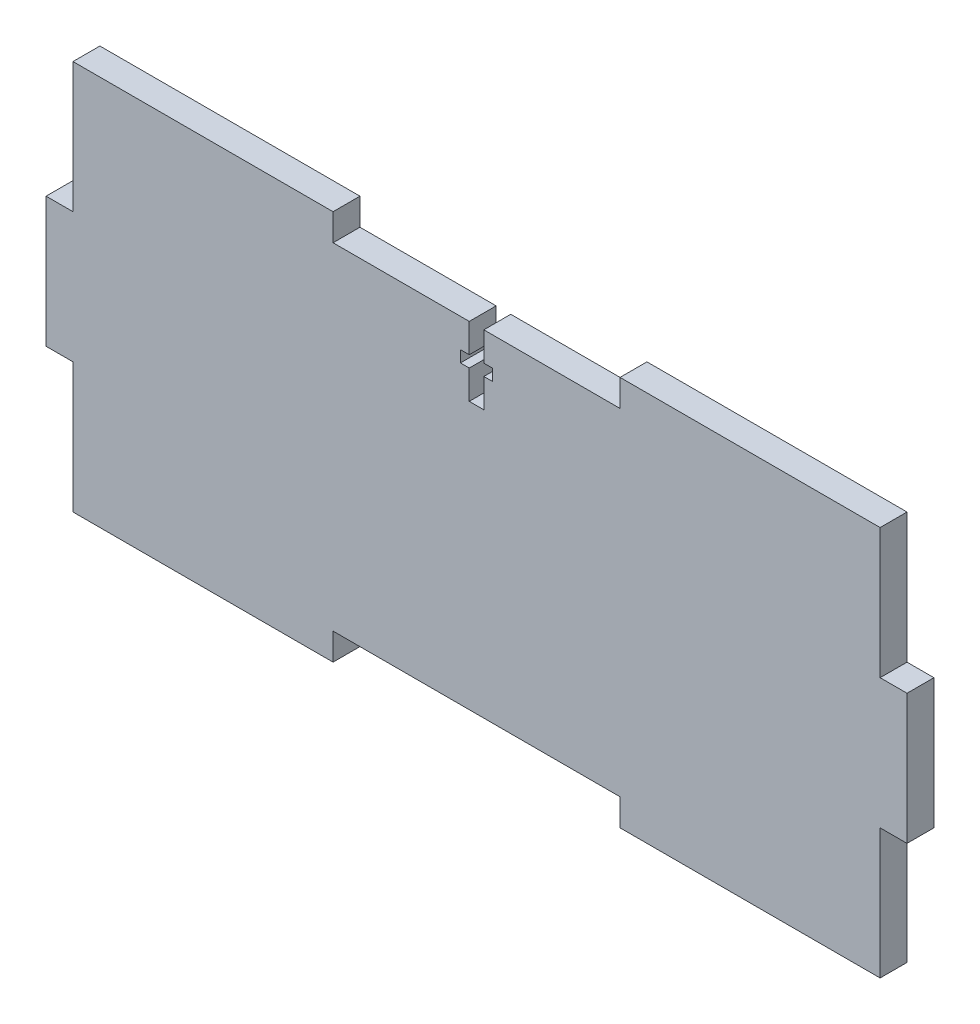
ISO-10303-21;
HEADER;
FILE_DESCRIPTION(('STEP AP214'),'2;1');
FILE_NAME('part.step','',(''),(''),'','','');
FILE_SCHEMA(('AUTOMOTIVE_DESIGN { 1 0 10303 214 1 1 1 1 }'));
ENDSEC;
DATA;
#1=APPLICATION_CONTEXT('core data for automotive mechanical design processes');
#2=APPLICATION_PROTOCOL_DEFINITION('international standard','automotive_design',2000,#1);
#3=PRODUCT_CONTEXT('',#1,'mechanical');
#4=PRODUCT('Part','Part','',(#3));
#5=PRODUCT_RELATED_PRODUCT_CATEGORY('part','',(#4));
#6=PRODUCT_DEFINITION_FORMATION('','',#4);
#7=PRODUCT_DEFINITION_CONTEXT('part definition',#1,'design');
#8=PRODUCT_DEFINITION('design','',#6,#7);
#9=PRODUCT_DEFINITION_SHAPE('','',#8);
#10=(LENGTH_UNIT() NAMED_UNIT(*) SI_UNIT(.MILLI.,.METRE.));
#11=(NAMED_UNIT(*) PLANE_ANGLE_UNIT() SI_UNIT($,.RADIAN.));
#12=(NAMED_UNIT(*) SI_UNIT($,.STERADIAN.) SOLID_ANGLE_UNIT());
#13=UNCERTAINTY_MEASURE_WITH_UNIT(LENGTH_MEASURE(1.E-05),#10,'distance_accuracy_value','');
#14=(GEOMETRIC_REPRESENTATION_CONTEXT(3) GLOBAL_UNCERTAINTY_ASSIGNED_CONTEXT((#13)) GLOBAL_UNIT_ASSIGNED_CONTEXT((#10,
#11,#12)) REPRESENTATION_CONTEXT('',''));
#15=CARTESIAN_POINT('',(0.,0.,0.));
#16=DIRECTION('',(0.,0.,1.));
#17=DIRECTION('',(1.,0.,0.));
#18=AXIS2_PLACEMENT_3D('',#15,#16,#17);
#19=CARTESIAN_POINT('',(-81.28,-36.83,5.08));
#20=DIRECTION('',(1.,0.,0.));
#21=DIRECTION('',(0.,0.,-1.));
#22=AXIS2_PLACEMENT_3D('',#19,#20,#21);
#23=PLANE('',#22);
#24=DIRECTION('',(0.,0.,1.));
#25=VECTOR('',#24,1.);
#26=CARTESIAN_POINT('',(-81.28,-12.2766666666667,5.08));
#27=LINE('',#26,#25);
#28=CARTESIAN_POINT('',(-81.28,-12.2766666666667,0.));
#29=VERTEX_POINT('',#28);
#30=CARTESIAN_POINT('',(-81.28,-12.2766666666667,5.08));
#31=VERTEX_POINT('',#30);
#32=EDGE_CURVE('E250',#29,#31,#27,.T.);
#33=ORIENTED_EDGE('',*,*,#32,.T.);
#34=DIRECTION('',(0.,-1.,0.));
#35=VECTOR('',#34,1.);
#36=CARTESIAN_POINT('',(-81.28,-36.83,5.08));
#37=LINE('',#36,#35);
#38=CARTESIAN_POINT('',(-81.28,12.2766666666667,5.08));
#39=VERTEX_POINT('',#38);
#40=EDGE_CURVE('E446',#39,#31,#37,.T.);
#41=ORIENTED_EDGE('',*,*,#40,.F.);
#42=DIRECTION('',(0.,0.,-1.));
#43=VECTOR('',#42,1.);
#44=CARTESIAN_POINT('',(-81.28,12.2766666666667,5.08));
#45=LINE('',#44,#43);
#46=CARTESIAN_POINT('',(-81.28,12.2766666666667,0.));
#47=VERTEX_POINT('',#46);
#48=EDGE_CURVE('E255',#39,#47,#45,.T.);
#49=ORIENTED_EDGE('',*,*,#48,.T.);
#50=DIRECTION('',(0.,-1.,0.));
#51=VECTOR('',#50,1.);
#52=CARTESIAN_POINT('',(-81.28,-36.83,0.));
#53=LINE('',#52,#51);
#54=EDGE_CURVE('E457',#47,#29,#53,.T.);
#55=ORIENTED_EDGE('',*,*,#54,.T.);
#56=EDGE_LOOP('',(#33,#41,#49,#55));
#57=FACE_BOUND('',#56,.T.);
#58=ADVANCED_FACE('F33',(#57),#23,.F.);
#59=CARTESIAN_POINT('',(81.28,-36.83,5.08));
#60=DIRECTION('',(-1.,0.,0.));
#61=DIRECTION('',(0.,0.,1.));
#62=AXIS2_PLACEMENT_3D('',#59,#60,#61);
#63=PLANE('',#62);
#64=DIRECTION('',(0.,0.,1.));
#65=VECTOR('',#64,1.);
#66=CARTESIAN_POINT('',(81.28,-12.2766666666667,5.08));
#67=LINE('',#66,#65);
#68=CARTESIAN_POINT('',(81.28,-12.2766666666667,0.));
#69=VERTEX_POINT('',#68);
#70=CARTESIAN_POINT('',(81.28,-12.2766666666667,5.08));
#71=VERTEX_POINT('',#70);
#72=EDGE_CURVE('E280',#69,#71,#67,.T.);
#73=ORIENTED_EDGE('',*,*,#72,.F.);
#74=DIRECTION('',(0.,1.,0.));
#75=VECTOR('',#74,1.);
#76=CARTESIAN_POINT('',(81.28,-36.83,0.));
#77=LINE('',#76,#75);
#78=CARTESIAN_POINT('',(81.28,12.2766666666667,0.));
#79=VERTEX_POINT('',#78);
#80=EDGE_CURVE('E432',#69,#79,#77,.T.);
#81=ORIENTED_EDGE('',*,*,#80,.T.);
#82=DIRECTION('',(0.,0.,-1.));
#83=VECTOR('',#82,1.);
#84=CARTESIAN_POINT('',(81.28,12.2766666666667,5.08));
#85=LINE('',#84,#83);
#86=CARTESIAN_POINT('',(81.28,12.2766666666667,5.08));
#87=VERTEX_POINT('',#86);
#88=EDGE_CURVE('E278',#87,#79,#85,.T.);
#89=ORIENTED_EDGE('',*,*,#88,.F.);
#90=DIRECTION('',(0.,1.,0.));
#91=VECTOR('',#90,1.);
#92=CARTESIAN_POINT('',(81.28,-36.83,5.08));
#93=LINE('',#92,#91);
#94=EDGE_CURVE('E440',#71,#87,#93,.T.);
#95=ORIENTED_EDGE('',*,*,#94,.F.);
#96=EDGE_LOOP('',(#73,#81,#89,#95));
#97=FACE_BOUND('',#96,.T.);
#98=ADVANCED_FACE('F35',(#97),#63,.F.);
#99=CARTESIAN_POINT('',(-81.28,36.83,5.08));
#100=DIRECTION('',(0.,-1.,0.));
#101=DIRECTION('',(0.,0.,-1.));
#102=AXIS2_PLACEMENT_3D('',#99,#100,#101);
#103=PLANE('',#102);
#104=DIRECTION('',(0.,0.,-1.));
#105=VECTOR('',#104,1.);
#106=CARTESIAN_POINT('',(76.2,36.83,-226.06));
#107=LINE('',#106,#105);
#108=CARTESIAN_POINT('',(76.2,36.83,5.08));
#109=VERTEX_POINT('',#108);
#110=CARTESIAN_POINT('',(76.2,36.83,0.));
#111=VERTEX_POINT('',#110);
#112=EDGE_CURVE('E302',#109,#111,#107,.T.);
#113=ORIENTED_EDGE('',*,*,#112,.T.);
#114=DIRECTION('',(-1.,0.,0.));
#115=VECTOR('',#114,1.);
#116=CARTESIAN_POINT('',(-81.28,36.83,0.));
#117=LINE('',#116,#115);
#118=CARTESIAN_POINT('',(27.0933333333333,36.83,0.));
#119=VERTEX_POINT('',#118);
#120=EDGE_CURVE('E455',#111,#119,#117,.T.);
#121=ORIENTED_EDGE('',*,*,#120,.T.);
#122=DIRECTION('',(0.,0.,1.));
#123=VECTOR('',#122,1.);
#124=CARTESIAN_POINT('',(27.0933333333333,36.83,0.));
#125=LINE('',#124,#123);
#126=CARTESIAN_POINT('',(27.0933333333333,36.83,5.08));
#127=VERTEX_POINT('',#126);
#128=EDGE_CURVE('E433',#119,#127,#125,.T.);
#129=ORIENTED_EDGE('',*,*,#128,.T.);
#130=DIRECTION('',(-1.,0.,0.));
#131=VECTOR('',#130,1.);
#132=CARTESIAN_POINT('',(-81.28,36.83,5.08));
#133=LINE('',#132,#131);
#134=EDGE_CURVE('E444',#109,#127,#133,.T.);
#135=ORIENTED_EDGE('',*,*,#134,.F.);
#136=EDGE_LOOP('',(#113,#121,#129,#135));
#137=FACE_BOUND('',#136,.T.);
#138=ADVANCED_FACE('F523',(#137),#103,.F.);
#139=CARTESIAN_POINT('',(-81.28,-36.83,5.08));
#140=DIRECTION('',(0.,1.,0.));
#141=DIRECTION('',(0.,0.,1.));
#142=AXIS2_PLACEMENT_3D('',#139,#140,#141);
#143=PLANE('',#142);
#144=DIRECTION('',(0.,0.,1.));
#145=VECTOR('',#144,1.);
#146=CARTESIAN_POINT('',(76.2,-36.83,-226.06));
#147=LINE('',#146,#145);
#148=CARTESIAN_POINT('',(76.2,-36.83,0.));
#149=VERTEX_POINT('',#148);
#150=CARTESIAN_POINT('',(76.2,-36.83,5.08));
#151=VERTEX_POINT('',#150);
#152=EDGE_CURVE('E305',#149,#151,#147,.T.);
#153=ORIENTED_EDGE('',*,*,#152,.T.);
#154=DIRECTION('',(1.,0.,0.));
#155=VECTOR('',#154,1.);
#156=CARTESIAN_POINT('',(-81.28,-36.83,5.08));
#157=LINE('',#156,#155);
#158=CARTESIAN_POINT('',(27.0933333333333,-36.83,5.08));
#159=VERTEX_POINT('',#158);
#160=EDGE_CURVE('E448',#159,#151,#157,.T.);
#161=ORIENTED_EDGE('',*,*,#160,.F.);
#162=DIRECTION('',(0.,0.,1.));
#163=VECTOR('',#162,1.);
#164=CARTESIAN_POINT('',(27.0933333333333,-36.83,0.));
#165=LINE('',#164,#163);
#166=CARTESIAN_POINT('',(27.0933333333333,-36.83,0.));
#167=VERTEX_POINT('',#166);
#168=EDGE_CURVE('E393',#167,#159,#165,.T.);
#169=ORIENTED_EDGE('',*,*,#168,.F.);
#170=DIRECTION('',(1.,0.,0.));
#171=VECTOR('',#170,1.);
#172=CARTESIAN_POINT('',(-81.28,-36.83,0.));
#173=LINE('',#172,#171);
#174=EDGE_CURVE('E460',#167,#149,#173,.T.);
#175=ORIENTED_EDGE('',*,*,#174,.T.);
#176=EDGE_LOOP('',(#153,#161,#169,#175));
#177=FACE_BOUND('',#176,.T.);
#178=ADVANCED_FACE('F478',(#177),#143,.F.);
#179=CARTESIAN_POINT('',(0.,0.,5.08));
#180=DIRECTION('',(0.,0.,-1.));
#181=DIRECTION('',(-1.,0.,0.));
#182=AXIS2_PLACEMENT_3D('',#179,#180,#181);
#183=PLANE('',#182);
#184=DIRECTION('',(-1.,0.,0.));
#185=VECTOR('',#184,1.);
#186=CARTESIAN_POINT('',(-76.2,-12.2766666666667,5.08));
#187=LINE('',#186,#185);
#188=CARTESIAN_POINT('',(-76.2,-12.2766666666667,5.08));
#189=VERTEX_POINT('',#188);
#190=EDGE_CURVE('E48',#189,#31,#187,.T.);
#191=ORIENTED_EDGE('',*,*,#190,.F.);
#192=DIRECTION('',(0.,1.,0.));
#193=VECTOR('',#192,1.);
#194=CARTESIAN_POINT('',(-76.2,-36.83,5.08));
#195=LINE('',#194,#193);
#196=CARTESIAN_POINT('',(-76.2,-36.83,5.08));
#197=VERTEX_POINT('',#196);
#198=EDGE_CURVE('E265',#197,#189,#195,.T.);
#199=ORIENTED_EDGE('',*,*,#198,.F.);
#200=CARTESIAN_POINT('',(-27.0933333333333,-36.83,5.08));
#201=VERTEX_POINT('',#200);
#202=EDGE_CURVE('E449',#197,#201,#157,.T.);
#203=ORIENTED_EDGE('',*,*,#202,.T.);
#204=DIRECTION('',(0.,-1.,0.));
#205=VECTOR('',#204,1.);
#206=CARTESIAN_POINT('',(-27.0933333333333,-36.83,5.08));
#207=LINE('',#206,#205);
#208=CARTESIAN_POINT('',(-27.0933333333333,-31.75,5.08));
#209=VERTEX_POINT('',#208);
#210=EDGE_CURVE('E387',#209,#201,#207,.T.);
#211=ORIENTED_EDGE('',*,*,#210,.F.);
#212=DIRECTION('',(-1.,0.,0.));
#213=VECTOR('',#212,1.);
#214=CARTESIAN_POINT('',(-27.0933333333333,-31.75,5.08));
#215=LINE('',#214,#213);
#216=CARTESIAN_POINT('',(27.0933333333333,-31.75,5.08));
#217=VERTEX_POINT('',#216);
#218=EDGE_CURVE('E396',#217,#209,#215,.T.);
#219=ORIENTED_EDGE('',*,*,#218,.F.);
#220=DIRECTION('',(0.,1.,0.));
#221=VECTOR('',#220,1.);
#222=CARTESIAN_POINT('',(27.0933333333333,-36.83,5.08));
#223=LINE('',#222,#221);
#224=EDGE_CURVE('E375',#159,#217,#223,.T.);
#225=ORIENTED_EDGE('',*,*,#224,.F.);
#226=ORIENTED_EDGE('',*,*,#160,.T.);
#227=DIRECTION('',(0.,1.,0.));
#228=VECTOR('',#227,1.);
#229=CARTESIAN_POINT('',(76.2,-36.83,5.08));
#230=LINE('',#229,#228);
#231=CARTESIAN_POINT('',(76.2,-12.2766666666667,5.08));
#232=VERTEX_POINT('',#231);
#233=EDGE_CURVE('E299',#151,#232,#230,.T.);
#234=ORIENTED_EDGE('',*,*,#233,.T.);
#235=DIRECTION('',(-1.,0.,0.));
#236=VECTOR('',#235,1.);
#237=CARTESIAN_POINT('',(81.28,-12.2766666666667,5.08));
#238=LINE('',#237,#236);
#239=EDGE_CURVE('E288',#71,#232,#238,.T.);
#240=ORIENTED_EDGE('',*,*,#239,.F.);
#241=ORIENTED_EDGE('',*,*,#94,.T.);
#242=DIRECTION('',(-1.,0.,0.));
#243=VECTOR('',#242,1.);
#244=CARTESIAN_POINT('',(81.28,12.2766666666667,5.08));
#245=LINE('',#244,#243);
#246=CARTESIAN_POINT('',(76.2,12.2766666666667,5.08));
#247=VERTEX_POINT('',#246);
#248=EDGE_CURVE('E283',#87,#247,#245,.T.);
#249=ORIENTED_EDGE('',*,*,#248,.T.);
#250=EDGE_CURVE('E291',#247,#109,#230,.T.);
#251=ORIENTED_EDGE('',*,*,#250,.T.);
#252=ORIENTED_EDGE('',*,*,#134,.T.);
#253=DIRECTION('',(0.,1.,0.));
#254=VECTOR('',#253,1.);
#255=CARTESIAN_POINT('',(27.0933333333333,36.83,5.08));
#256=LINE('',#255,#254);
#257=CARTESIAN_POINT('',(27.0933333333333,31.75,5.08));
#258=VERTEX_POINT('',#257);
#259=EDGE_CURVE('E414',#258,#127,#256,.T.);
#260=ORIENTED_EDGE('',*,*,#259,.F.);
#261=DIRECTION('',(1.,0.,0.));
#262=VECTOR('',#261,1.);
#263=CARTESIAN_POINT('',(-27.0933333333333,31.75,5.08));
#264=LINE('',#263,#262);
#265=CARTESIAN_POINT('',(1.37795,31.75,5.08));
#266=VERTEX_POINT('',#265);
#267=EDGE_CURVE('E424',#266,#258,#264,.T.);
#268=ORIENTED_EDGE('',*,*,#267,.F.);
#269=DIRECTION('',(0.,1.,0.));
#270=VECTOR('',#269,1.);
#271=CARTESIAN_POINT('',(1.37795,31.75,5.08));
#272=LINE('',#271,#270);
#273=CARTESIAN_POINT('',(1.37795,26.29535,5.08));
#274=VERTEX_POINT('',#273);
#275=EDGE_CURVE('E369',#274,#266,#272,.T.);
#276=ORIENTED_EDGE('',*,*,#275,.F.);
#277=DIRECTION('',(-1.,0.,0.));
#278=VECTOR('',#277,1.);
#279=CARTESIAN_POINT('',(-3.048,26.29535,5.08));
#280=LINE('',#279,#278);
#281=CARTESIAN_POINT('',(3.048,26.29535,5.08));
#282=VERTEX_POINT('',#281);
#283=EDGE_CURVE('E313',#282,#274,#280,.T.);
#284=ORIENTED_EDGE('',*,*,#283,.F.);
#285=DIRECTION('',(0.,1.,0.));
#286=VECTOR('',#285,1.);
#287=CARTESIAN_POINT('',(3.048,26.29535,5.08));
#288=LINE('',#287,#286);
#289=CARTESIAN_POINT('',(3.048,24.12365,5.08));
#290=VERTEX_POINT('',#289);
#291=EDGE_CURVE('E330',#290,#282,#288,.T.);
#292=ORIENTED_EDGE('',*,*,#291,.F.);
#293=DIRECTION('',(1.,0.,0.));
#294=VECTOR('',#293,1.);
#295=CARTESIAN_POINT('',(-3.048,24.12365,5.08));
#296=LINE('',#295,#294);
#297=CARTESIAN_POINT('',(1.37795,24.12365,5.08));
#298=VERTEX_POINT('',#297);
#299=EDGE_CURVE('E327',#298,#290,#296,.T.);
#300=ORIENTED_EDGE('',*,*,#299,.F.);
#301=CARTESIAN_POINT('',(1.37795,18.669,5.08));
#302=VERTEX_POINT('',#301);
#303=EDGE_CURVE('E370',#302,#298,#272,.T.);
#304=ORIENTED_EDGE('',*,*,#303,.F.);
#305=DIRECTION('',(1.,0.,0.));
#306=VECTOR('',#305,1.);
#307=CARTESIAN_POINT('',(-1.37795,18.669,5.08));
#308=LINE('',#307,#306);
#309=CARTESIAN_POINT('',(-1.37795,18.669,5.08));
#310=VERTEX_POINT('',#309);
#311=EDGE_CURVE('E366',#310,#302,#308,.T.);
#312=ORIENTED_EDGE('',*,*,#311,.F.);
#313=DIRECTION('',(0.,-1.,0.));
#314=VECTOR('',#313,1.);
#315=CARTESIAN_POINT('',(-1.37795,31.75,5.08));
#316=LINE('',#315,#314);
#317=CARTESIAN_POINT('',(-1.37795,24.12365,5.08));
#318=VERTEX_POINT('',#317);
#319=EDGE_CURVE('E350',#318,#310,#316,.T.);
#320=ORIENTED_EDGE('',*,*,#319,.F.);
#321=CARTESIAN_POINT('',(-3.048,24.12365,5.08));
#322=VERTEX_POINT('',#321);
#323=EDGE_CURVE('E328',#322,#318,#296,.T.);
#324=ORIENTED_EDGE('',*,*,#323,.F.);
#325=DIRECTION('',(0.,-1.,0.));
#326=VECTOR('',#325,1.);
#327=CARTESIAN_POINT('',(-3.048,26.29535,5.08));
#328=LINE('',#327,#326);
#329=CARTESIAN_POINT('',(-3.048,26.29535,5.08));
#330=VERTEX_POINT('',#329);
#331=EDGE_CURVE('E308',#330,#322,#328,.T.);
#332=ORIENTED_EDGE('',*,*,#331,.F.);
#333=CARTESIAN_POINT('',(-1.37795,26.29535,5.08));
#334=VERTEX_POINT('',#333);
#335=EDGE_CURVE('E333',#334,#330,#280,.T.);
#336=ORIENTED_EDGE('',*,*,#335,.F.);
#337=CARTESIAN_POINT('',(-1.37795,31.75,5.08));
#338=VERTEX_POINT('',#337);
#339=EDGE_CURVE('E363',#338,#334,#316,.T.);
#340=ORIENTED_EDGE('',*,*,#339,.F.);
#341=CARTESIAN_POINT('',(-27.0933333333333,31.75,5.08));
#342=VERTEX_POINT('',#341);
#343=EDGE_CURVE('E425',#342,#338,#264,.T.);
#344=ORIENTED_EDGE('',*,*,#343,.F.);
#345=DIRECTION('',(0.,-1.,0.));
#346=VECTOR('',#345,1.);
#347=CARTESIAN_POINT('',(-27.0933333333333,36.83,5.08));
#348=LINE('',#347,#346);
#349=CARTESIAN_POINT('',(-27.0933333333333,36.83,5.08));
#350=VERTEX_POINT('',#349);
#351=EDGE_CURVE('E404',#350,#342,#348,.T.);
#352=ORIENTED_EDGE('',*,*,#351,.F.);
#353=CARTESIAN_POINT('',(-76.2,36.83,5.08));
#354=VERTEX_POINT('',#353);
#355=EDGE_CURVE('E264',#350,#354,#133,.T.);
#356=ORIENTED_EDGE('',*,*,#355,.T.);
#357=CARTESIAN_POINT('',(-76.2,12.2766666666667,5.08));
#358=VERTEX_POINT('',#357);
#359=EDGE_CURVE('E245',#358,#354,#195,.T.);
#360=ORIENTED_EDGE('',*,*,#359,.F.);
#361=DIRECTION('',(-1.,0.,0.));
#362=VECTOR('',#361,1.);
#363=CARTESIAN_POINT('',(-76.2,12.2766666666667,5.08));
#364=LINE('',#363,#362);
#365=EDGE_CURVE('E253',#358,#39,#364,.T.);
#366=ORIENTED_EDGE('',*,*,#365,.T.);
#367=ORIENTED_EDGE('',*,*,#40,.T.);
#368=EDGE_LOOP('',(#191,#199,#203,#211,#219,#225,#226,#234,#240,#241,#249,#251,#252,#260,#268,
#276,#284,#292,#300,#304,#312,#320,#324,#332,#336,#340,#344,#352,#356,#360,#366,#367));
#369=FACE_BOUND('',#368,.T.);
#370=ADVANCED_FACE('F261',(#369),#183,.F.);
#371=CARTESIAN_POINT('',(0.,0.,0.));
#372=DIRECTION('',(0.,0.,-1.));
#373=DIRECTION('',(-1.,0.,0.));
#374=AXIS2_PLACEMENT_3D('',#371,#372,#373);
#375=PLANE('',#374);
#376=DIRECTION('',(0.,-1.,0.));
#377=VECTOR('',#376,1.);
#378=CARTESIAN_POINT('',(-76.2,0.,0.));
#379=LINE('',#378,#377);
#380=CARTESIAN_POINT('',(-76.2,36.83,0.));
#381=VERTEX_POINT('',#380);
#382=CARTESIAN_POINT('',(-76.2,12.2766666666667,0.));
#383=VERTEX_POINT('',#382);
#384=EDGE_CURVE('E248',#381,#383,#379,.T.);
#385=ORIENTED_EDGE('',*,*,#384,.F.);
#386=CARTESIAN_POINT('',(-27.0933333333333,36.83,0.));
#387=VERTEX_POINT('',#386);
#388=EDGE_CURVE('E454',#387,#381,#117,.T.);
#389=ORIENTED_EDGE('',*,*,#388,.F.);
#390=DIRECTION('',(0.,-1.,0.));
#391=VECTOR('',#390,1.);
#392=CARTESIAN_POINT('',(-27.0933333333333,36.83,0.));
#393=LINE('',#392,#391);
#394=CARTESIAN_POINT('',(-27.0933333333333,31.75,0.));
#395=VERTEX_POINT('',#394);
#396=EDGE_CURVE('E410',#387,#395,#393,.T.);
#397=ORIENTED_EDGE('',*,*,#396,.T.);
#398=DIRECTION('',(1.,0.,0.));
#399=VECTOR('',#398,1.);
#400=CARTESIAN_POINT('',(-27.0933333333333,31.75,0.));
#401=LINE('',#400,#399);
#402=CARTESIAN_POINT('',(-1.37795,31.75,0.));
#403=VERTEX_POINT('',#402);
#404=EDGE_CURVE('E415',#395,#403,#401,.T.);
#405=ORIENTED_EDGE('',*,*,#404,.T.);
#406=DIRECTION('',(0.,-1.,0.));
#407=VECTOR('',#406,1.);
#408=CARTESIAN_POINT('',(-1.37795,31.75,0.));
#409=LINE('',#408,#407);
#410=CARTESIAN_POINT('',(-1.37795,26.29535,0.));
#411=VERTEX_POINT('',#410);
#412=EDGE_CURVE('E351',#403,#411,#409,.T.);
#413=ORIENTED_EDGE('',*,*,#412,.T.);
#414=DIRECTION('',(-1.,0.,0.));
#415=VECTOR('',#414,1.);
#416=CARTESIAN_POINT('',(-3.048,26.29535,0.));
#417=LINE('',#416,#415);
#418=CARTESIAN_POINT('',(-3.048,26.29535,0.));
#419=VERTEX_POINT('',#418);
#420=EDGE_CURVE('E320',#411,#419,#417,.T.);
#421=ORIENTED_EDGE('',*,*,#420,.T.);
#422=DIRECTION('',(0.,-1.,0.));
#423=VECTOR('',#422,1.);
#424=CARTESIAN_POINT('',(-3.048,26.29535,0.));
#425=LINE('',#424,#423);
#426=CARTESIAN_POINT('',(-3.048,24.12365,0.));
#427=VERTEX_POINT('',#426);
#428=EDGE_CURVE('E309',#419,#427,#425,.T.);
#429=ORIENTED_EDGE('',*,*,#428,.T.);
#430=DIRECTION('',(1.,0.,0.));
#431=VECTOR('',#430,1.);
#432=CARTESIAN_POINT('',(-3.048,24.12365,0.));
#433=LINE('',#432,#431);
#434=CARTESIAN_POINT('',(-1.37795,24.12365,0.));
#435=VERTEX_POINT('',#434);
#436=EDGE_CURVE('E314',#427,#435,#433,.T.);
#437=ORIENTED_EDGE('',*,*,#436,.T.);
#438=CARTESIAN_POINT('',(-1.37795,18.669,0.));
#439=VERTEX_POINT('',#438);
#440=EDGE_CURVE('E355',#435,#439,#409,.T.);
#441=ORIENTED_EDGE('',*,*,#440,.T.);
#442=DIRECTION('',(1.,0.,0.));
#443=VECTOR('',#442,1.);
#444=CARTESIAN_POINT('',(-1.37795,18.669,0.));
#445=LINE('',#444,#443);
#446=CARTESIAN_POINT('',(1.37795,18.669,0.));
#447=VERTEX_POINT('',#446);
#448=EDGE_CURVE('E354',#439,#447,#445,.T.);
#449=ORIENTED_EDGE('',*,*,#448,.T.);
#450=DIRECTION('',(0.,1.,0.));
#451=VECTOR('',#450,1.);
#452=CARTESIAN_POINT('',(1.37795,31.75,0.));
#453=LINE('',#452,#451);
#454=CARTESIAN_POINT('',(1.37795,24.12365,0.));
#455=VERTEX_POINT('',#454);
#456=EDGE_CURVE('E359',#447,#455,#453,.T.);
#457=ORIENTED_EDGE('',*,*,#456,.T.);
#458=CARTESIAN_POINT('',(3.048,24.12365,0.));
#459=VERTEX_POINT('',#458);
#460=EDGE_CURVE('E312',#455,#459,#433,.T.);
#461=ORIENTED_EDGE('',*,*,#460,.T.);
#462=DIRECTION('',(0.,1.,0.));
#463=VECTOR('',#462,1.);
#464=CARTESIAN_POINT('',(3.048,26.29535,0.));
#465=LINE('',#464,#463);
#466=CARTESIAN_POINT('',(3.048,26.29535,0.));
#467=VERTEX_POINT('',#466);
#468=EDGE_CURVE('E317',#459,#467,#465,.T.);
#469=ORIENTED_EDGE('',*,*,#468,.T.);
#470=CARTESIAN_POINT('',(1.37795,26.29535,0.));
#471=VERTEX_POINT('',#470);
#472=EDGE_CURVE('E321',#467,#471,#417,.T.);
#473=ORIENTED_EDGE('',*,*,#472,.T.);
#474=CARTESIAN_POINT('',(1.37795,31.75,0.));
#475=VERTEX_POINT('',#474);
#476=EDGE_CURVE('E358',#471,#475,#453,.T.);
#477=ORIENTED_EDGE('',*,*,#476,.T.);
#478=CARTESIAN_POINT('',(27.0933333333333,31.75,0.));
#479=VERTEX_POINT('',#478);
#480=EDGE_CURVE('E413',#475,#479,#401,.T.);
#481=ORIENTED_EDGE('',*,*,#480,.T.);
#482=DIRECTION('',(0.,1.,0.));
#483=VECTOR('',#482,1.);
#484=CARTESIAN_POINT('',(27.0933333333333,36.83,0.));
#485=LINE('',#484,#483);
#486=EDGE_CURVE('E418',#479,#119,#485,.T.);
#487=ORIENTED_EDGE('',*,*,#486,.T.);
#488=ORIENTED_EDGE('',*,*,#120,.F.);
#489=DIRECTION('',(0.,-1.,0.));
#490=VECTOR('',#489,1.);
#491=CARTESIAN_POINT('',(76.2,0.,0.));
#492=LINE('',#491,#490);
#493=CARTESIAN_POINT('',(76.2,12.2766666666667,0.));
#494=VERTEX_POINT('',#493);
#495=EDGE_CURVE('E11',#111,#494,#492,.T.);
#496=ORIENTED_EDGE('',*,*,#495,.T.);
#497=DIRECTION('',(-1.,0.,0.));
#498=VECTOR('',#497,1.);
#499=CARTESIAN_POINT('',(81.28,12.2766666666667,0.));
#500=LINE('',#499,#498);
#501=EDGE_CURVE('E295',#79,#494,#500,.T.);
#502=ORIENTED_EDGE('',*,*,#501,.F.);
#503=ORIENTED_EDGE('',*,*,#80,.F.);
#504=DIRECTION('',(-1.,0.,0.));
#505=VECTOR('',#504,1.);
#506=CARTESIAN_POINT('',(81.28,-12.2766666666667,0.));
#507=LINE('',#506,#505);
#508=CARTESIAN_POINT('',(76.2,-12.2766666666667,0.));
#509=VERTEX_POINT('',#508);
#510=EDGE_CURVE('E292',#69,#509,#507,.T.);
#511=ORIENTED_EDGE('',*,*,#510,.T.);
#512=EDGE_CURVE('E41',#509,#149,#492,.T.);
#513=ORIENTED_EDGE('',*,*,#512,.T.);
#514=ORIENTED_EDGE('',*,*,#174,.F.);
#515=DIRECTION('',(0.,1.,0.));
#516=VECTOR('',#515,1.);
#517=CARTESIAN_POINT('',(27.0933333333333,-36.83,0.));
#518=LINE('',#517,#516);
#519=CARTESIAN_POINT('',(27.0933333333333,-31.75,0.));
#520=VERTEX_POINT('',#519);
#521=EDGE_CURVE('E383',#167,#520,#518,.T.);
#522=ORIENTED_EDGE('',*,*,#521,.T.);
#523=DIRECTION('',(-1.,0.,0.));
#524=VECTOR('',#523,1.);
#525=CARTESIAN_POINT('',(-27.0933333333333,-31.75,0.));
#526=LINE('',#525,#524);
#527=CARTESIAN_POINT('',(-27.0933333333333,-31.75,0.));
#528=VERTEX_POINT('',#527);
#529=EDGE_CURVE('E386',#520,#528,#526,.T.);
#530=ORIENTED_EDGE('',*,*,#529,.T.);
#531=DIRECTION('',(0.,-1.,0.));
#532=VECTOR('',#531,1.);
#533=CARTESIAN_POINT('',(-27.0933333333333,-36.83,0.));
#534=LINE('',#533,#532);
#535=CARTESIAN_POINT('',(-27.0933333333333,-36.83,0.));
#536=VERTEX_POINT('',#535);
#537=EDGE_CURVE('E390',#528,#536,#534,.T.);
#538=ORIENTED_EDGE('',*,*,#537,.T.);
#539=CARTESIAN_POINT('',(-76.2,-36.83,0.));
#540=VERTEX_POINT('',#539);
#541=EDGE_CURVE('E443',#540,#536,#173,.T.);
#542=ORIENTED_EDGE('',*,*,#541,.F.);
#543=CARTESIAN_POINT('',(-76.2,-12.2766666666667,0.));
#544=VERTEX_POINT('',#543);
#545=EDGE_CURVE('E276',#544,#540,#379,.T.);
#546=ORIENTED_EDGE('',*,*,#545,.F.);
#547=DIRECTION('',(-1.,0.,0.));
#548=VECTOR('',#547,1.);
#549=CARTESIAN_POINT('',(-76.2,-12.2766666666667,0.));
#550=LINE('',#549,#548);
#551=EDGE_CURVE('E269',#544,#29,#550,.T.);
#552=ORIENTED_EDGE('',*,*,#551,.T.);
#553=ORIENTED_EDGE('',*,*,#54,.F.);
#554=DIRECTION('',(-1.,0.,0.));
#555=VECTOR('',#554,1.);
#556=CARTESIAN_POINT('',(-76.2,12.2766666666667,0.));
#557=LINE('',#556,#555);
#558=EDGE_CURVE('E56',#383,#47,#557,.T.);
#559=ORIENTED_EDGE('',*,*,#558,.F.);
#560=EDGE_LOOP('',(#385,#389,#397,#405,#413,#421,#429,#437,#441,#449,#457,#461,#469,#473,#477,
#481,#487,#488,#496,#502,#503,#511,#513,#514,#522,#530,#538,#542,#546,#552,#553,#559));
#561=FACE_BOUND('',#560,.T.);
#562=ADVANCED_FACE('F473',(#561),#375,.T.);
#563=CARTESIAN_POINT('',(-1.37795,31.75,0.));
#564=DIRECTION('',(-1.,0.,0.));
#565=DIRECTION('',(0.,-1.,0.));
#566=AXIS2_PLACEMENT_3D('',#563,#564,#565);
#567=PLANE('',#566);
#568=ORIENTED_EDGE('',*,*,#339,.T.);
#569=DIRECTION('',(0.,0.,-1.));
#570=VECTOR('',#569,1.);
#571=CARTESIAN_POINT('',(-1.37795,26.29535,0.));
#572=LINE('',#571,#570);
#573=EDGE_CURVE('E347',#334,#411,#572,.T.);
#574=ORIENTED_EDGE('',*,*,#573,.T.);
#575=ORIENTED_EDGE('',*,*,#412,.F.);
#576=DIRECTION('',(0.,0.,1.));
#577=VECTOR('',#576,1.);
#578=CARTESIAN_POINT('',(-1.37795,31.75,0.));
#579=LINE('',#578,#577);
#580=EDGE_CURVE('E373',#403,#338,#579,.T.);
#581=ORIENTED_EDGE('',*,*,#580,.T.);
#582=EDGE_LOOP('',(#568,#574,#575,#581));
#583=FACE_BOUND('',#582,.T.);
#584=ADVANCED_FACE('F553',(#583),#567,.F.);
#585=CARTESIAN_POINT('',(1.37795,31.75,0.));
#586=DIRECTION('',(1.,0.,0.));
#587=DIRECTION('',(0.,1.,0.));
#588=AXIS2_PLACEMENT_3D('',#585,#586,#587);
#589=PLANE('',#588);
#590=ORIENTED_EDGE('',*,*,#476,.F.);
#591=DIRECTION('',(0.,0.,1.));
#592=VECTOR('',#591,1.);
#593=CARTESIAN_POINT('',(1.37795,26.29535,0.));
#594=LINE('',#593,#592);
#595=EDGE_CURVE('E463',#471,#274,#594,.T.);
#596=ORIENTED_EDGE('',*,*,#595,.T.);
#597=ORIENTED_EDGE('',*,*,#275,.T.);
#598=DIRECTION('',(0.,0.,1.));
#599=VECTOR('',#598,1.);
#600=CARTESIAN_POINT('',(1.37795,31.75,0.));
#601=LINE('',#600,#599);
#602=EDGE_CURVE('E376',#475,#266,#601,.T.);
#603=ORIENTED_EDGE('',*,*,#602,.F.);
#604=EDGE_LOOP('',(#590,#596,#597,#603));
#605=FACE_BOUND('',#604,.T.);
#606=ADVANCED_FACE('F590',(#605),#589,.F.);
#607=CARTESIAN_POINT('',(-27.0933333333333,31.75,0.));
#608=DIRECTION('',(0.,-1.,0.));
#609=DIRECTION('',(0.,0.,-1.));
#610=AXIS2_PLACEMENT_3D('',#607,#608,#609);
#611=PLANE('',#610);
#612=ORIENTED_EDGE('',*,*,#343,.T.);
#613=ORIENTED_EDGE('',*,*,#580,.F.);
#614=ORIENTED_EDGE('',*,*,#404,.F.);
#615=DIRECTION('',(0.,0.,1.));
#616=VECTOR('',#615,1.);
#617=CARTESIAN_POINT('',(-27.0933333333333,31.75,0.));
#618=LINE('',#617,#616);
#619=EDGE_CURVE('E421',#395,#342,#618,.T.);
#620=ORIENTED_EDGE('',*,*,#619,.T.);
#621=EDGE_LOOP('',(#612,#613,#614,#620));
#622=FACE_BOUND('',#621,.T.);
#623=ADVANCED_FACE('F543',(#622),#611,.F.);
#624=ORIENTED_EDGE('',*,*,#202,.F.);
#625=DIRECTION('',(0.,0.,1.));
#626=VECTOR('',#625,1.);
#627=CARTESIAN_POINT('',(-76.2,-36.83,-226.06));
#628=LINE('',#627,#626);
#629=EDGE_CURVE('E274',#540,#197,#628,.T.);
#630=ORIENTED_EDGE('',*,*,#629,.F.);
#631=ORIENTED_EDGE('',*,*,#541,.T.);
#632=DIRECTION('',(0.,0.,1.));
#633=VECTOR('',#632,1.);
#634=CARTESIAN_POINT('',(-27.0933333333333,-36.83,0.));
#635=LINE('',#634,#633);
#636=EDGE_CURVE('E401',#536,#201,#635,.T.);
#637=ORIENTED_EDGE('',*,*,#636,.T.);
#638=EDGE_LOOP('',(#624,#630,#631,#637));
#639=FACE_BOUND('',#638,.T.);
#640=ADVANCED_FACE('F497',(#639),#143,.F.);
#641=ORIENTED_EDGE('',*,*,#388,.T.);
#642=DIRECTION('',(0.,0.,-1.));
#643=VECTOR('',#642,1.);
#644=CARTESIAN_POINT('',(-76.2,36.83,-226.06));
#645=LINE('',#644,#643);
#646=EDGE_CURVE('E268',#354,#381,#645,.T.);
#647=ORIENTED_EDGE('',*,*,#646,.F.);
#648=ORIENTED_EDGE('',*,*,#355,.F.);
#649=DIRECTION('',(0.,0.,1.));
#650=VECTOR('',#649,1.);
#651=CARTESIAN_POINT('',(-27.0933333333333,36.83,0.));
#652=LINE('',#651,#650);
#653=EDGE_CURVE('E430',#387,#350,#652,.T.);
#654=ORIENTED_EDGE('',*,*,#653,.F.);
#655=EDGE_LOOP('',(#641,#647,#648,#654));
#656=FACE_BOUND('',#655,.T.);
#657=ADVANCED_FACE('F529',(#656),#103,.F.);
#658=CARTESIAN_POINT('',(-27.0933333333333,36.83,0.));
#659=DIRECTION('',(-1.,0.,0.));
#660=DIRECTION('',(0.,0.,1.));
#661=AXIS2_PLACEMENT_3D('',#658,#659,#660);
#662=PLANE('',#661);
#663=ORIENTED_EDGE('',*,*,#351,.T.);
#664=ORIENTED_EDGE('',*,*,#619,.F.);
#665=ORIENTED_EDGE('',*,*,#396,.F.);
#666=ORIENTED_EDGE('',*,*,#653,.T.);
#667=EDGE_LOOP('',(#663,#664,#665,#666));
#668=FACE_BOUND('',#667,.T.);
#669=ADVANCED_FACE('F534',(#668),#662,.F.);
#670=CARTESIAN_POINT('',(27.0933333333333,36.83,0.));
#671=DIRECTION('',(1.,0.,0.));
#672=DIRECTION('',(0.,0.,-1.));
#673=AXIS2_PLACEMENT_3D('',#670,#671,#672);
#674=PLANE('',#673);
#675=ORIENTED_EDGE('',*,*,#259,.T.);
#676=ORIENTED_EDGE('',*,*,#128,.F.);
#677=ORIENTED_EDGE('',*,*,#486,.F.);
#678=DIRECTION('',(0.,0.,1.));
#679=VECTOR('',#678,1.);
#680=CARTESIAN_POINT('',(27.0933333333333,31.75,0.));
#681=LINE('',#680,#679);
#682=EDGE_CURVE('E436',#479,#258,#681,.T.);
#683=ORIENTED_EDGE('',*,*,#682,.T.);
#684=EDGE_LOOP('',(#675,#676,#677,#683));
#685=FACE_BOUND('',#684,.T.);
#686=ADVANCED_FACE('F540',(#685),#674,.F.);
#687=ORIENTED_EDGE('',*,*,#480,.F.);
#688=ORIENTED_EDGE('',*,*,#602,.T.);
#689=ORIENTED_EDGE('',*,*,#267,.T.);
#690=ORIENTED_EDGE('',*,*,#682,.F.);
#691=EDGE_LOOP('',(#687,#688,#689,#690));
#692=FACE_BOUND('',#691,.T.);
#693=ADVANCED_FACE('F595',(#692),#611,.F.);
#694=CARTESIAN_POINT('',(-27.0933333333333,-36.83,0.));
#695=DIRECTION('',(-1.,0.,0.));
#696=DIRECTION('',(0.,0.,1.));
#697=AXIS2_PLACEMENT_3D('',#694,#695,#696);
#698=PLANE('',#697);
#699=ORIENTED_EDGE('',*,*,#210,.T.);
#700=ORIENTED_EDGE('',*,*,#636,.F.);
#701=ORIENTED_EDGE('',*,*,#537,.F.);
#702=DIRECTION('',(0.,0.,1.));
#703=VECTOR('',#702,1.);
#704=CARTESIAN_POINT('',(-27.0933333333333,-31.75,0.));
#705=LINE('',#704,#703);
#706=EDGE_CURVE('E405',#528,#209,#705,.T.);
#707=ORIENTED_EDGE('',*,*,#706,.T.);
#708=EDGE_LOOP('',(#699,#700,#701,#707));
#709=FACE_BOUND('',#708,.T.);
#710=ADVANCED_FACE('F494',(#709),#698,.F.);
#711=CARTESIAN_POINT('',(-27.0933333333333,-31.75,0.));
#712=DIRECTION('',(0.,1.,0.));
#713=DIRECTION('',(0.,0.,1.));
#714=AXIS2_PLACEMENT_3D('',#711,#712,#713);
#715=PLANE('',#714);
#716=ORIENTED_EDGE('',*,*,#218,.T.);
#717=ORIENTED_EDGE('',*,*,#706,.F.);
#718=ORIENTED_EDGE('',*,*,#529,.F.);
#719=DIRECTION('',(0.,0.,1.));
#720=VECTOR('',#719,1.);
#721=CARTESIAN_POINT('',(27.0933333333333,-31.75,0.));
#722=LINE('',#721,#720);
#723=EDGE_CURVE('E407',#520,#217,#722,.T.);
#724=ORIENTED_EDGE('',*,*,#723,.T.);
#725=EDGE_LOOP('',(#716,#717,#718,#724));
#726=FACE_BOUND('',#725,.T.);
#727=ADVANCED_FACE('F488',(#726),#715,.F.);
#728=CARTESIAN_POINT('',(27.0933333333333,-36.83,0.));
#729=DIRECTION('',(1.,0.,0.));
#730=DIRECTION('',(0.,0.,-1.));
#731=AXIS2_PLACEMENT_3D('',#728,#729,#730);
#732=PLANE('',#731);
#733=ORIENTED_EDGE('',*,*,#224,.T.);
#734=ORIENTED_EDGE('',*,*,#723,.F.);
#735=ORIENTED_EDGE('',*,*,#521,.F.);
#736=ORIENTED_EDGE('',*,*,#168,.T.);
#737=EDGE_LOOP('',(#733,#734,#735,#736));
#738=FACE_BOUND('',#737,.T.);
#739=ADVANCED_FACE('F483',(#738),#732,.F.);
#740=ORIENTED_EDGE('',*,*,#440,.F.);
#741=DIRECTION('',(0.,0.,1.));
#742=VECTOR('',#741,1.);
#743=CARTESIAN_POINT('',(-1.37795,24.12365,0.));
#744=LINE('',#743,#742);
#745=EDGE_CURVE('E338',#435,#318,#744,.T.);
#746=ORIENTED_EDGE('',*,*,#745,.T.);
#747=ORIENTED_EDGE('',*,*,#319,.T.);
#748=DIRECTION('',(0.,0.,1.));
#749=VECTOR('',#748,1.);
#750=CARTESIAN_POINT('',(-1.37795,18.669,0.));
#751=LINE('',#750,#749);
#752=EDGE_CURVE('E362',#439,#310,#751,.T.);
#753=ORIENTED_EDGE('',*,*,#752,.F.);
#754=EDGE_LOOP('',(#740,#746,#747,#753));
#755=FACE_BOUND('',#754,.T.);
#756=ADVANCED_FACE('F568',(#755),#567,.F.);
#757=ORIENTED_EDGE('',*,*,#303,.T.);
#758=DIRECTION('',(0.,0.,-1.));
#759=VECTOR('',#758,1.);
#760=CARTESIAN_POINT('',(1.37795,24.12365,0.));
#761=LINE('',#760,#759);
#762=EDGE_CURVE('E451',#298,#455,#761,.T.);
#763=ORIENTED_EDGE('',*,*,#762,.T.);
#764=ORIENTED_EDGE('',*,*,#456,.F.);
#765=DIRECTION('',(0.,0.,1.));
#766=VECTOR('',#765,1.);
#767=CARTESIAN_POINT('',(1.37795,18.669,0.));
#768=LINE('',#767,#766);
#769=EDGE_CURVE('E379',#447,#302,#768,.T.);
#770=ORIENTED_EDGE('',*,*,#769,.T.);
#771=EDGE_LOOP('',(#757,#763,#764,#770));
#772=FACE_BOUND('',#771,.T.);
#773=ADVANCED_FACE('F577',(#772),#589,.F.);
#774=CARTESIAN_POINT('',(-1.37795,18.669,0.));
#775=DIRECTION('',(0.,-1.,0.));
#776=DIRECTION('',(0.,0.,-1.));
#777=AXIS2_PLACEMENT_3D('',#774,#775,#776);
#778=PLANE('',#777);
#779=ORIENTED_EDGE('',*,*,#311,.T.);
#780=ORIENTED_EDGE('',*,*,#769,.F.);
#781=ORIENTED_EDGE('',*,*,#448,.F.);
#782=ORIENTED_EDGE('',*,*,#752,.T.);
#783=EDGE_LOOP('',(#779,#780,#781,#782));
#784=FACE_BOUND('',#783,.T.);
#785=ADVANCED_FACE('F573',(#784),#778,.F.);
#786=CARTESIAN_POINT('',(-3.048,26.29535,0.));
#787=DIRECTION('',(0.,1.,0.));
#788=DIRECTION('',(0.,0.,1.));
#789=AXIS2_PLACEMENT_3D('',#786,#787,#788);
#790=PLANE('',#789);
#791=ORIENTED_EDGE('',*,*,#472,.F.);
#792=DIRECTION('',(0.,0.,1.));
#793=VECTOR('',#792,1.);
#794=CARTESIAN_POINT('',(3.048,26.29535,0.));
#795=LINE('',#794,#793);
#796=EDGE_CURVE('E339',#467,#282,#795,.T.);
#797=ORIENTED_EDGE('',*,*,#796,.T.);
#798=ORIENTED_EDGE('',*,*,#283,.T.);
#799=ORIENTED_EDGE('',*,*,#595,.F.);
#800=EDGE_LOOP('',(#791,#797,#798,#799));
#801=FACE_BOUND('',#800,.T.);
#802=ADVANCED_FACE('F628',(#801),#790,.F.);
#803=CARTESIAN_POINT('',(-3.048,24.12365,0.));
#804=DIRECTION('',(0.,-1.,0.));
#805=DIRECTION('',(0.,0.,-1.));
#806=AXIS2_PLACEMENT_3D('',#803,#804,#805);
#807=PLANE('',#806);
#808=ORIENTED_EDGE('',*,*,#299,.T.);
#809=DIRECTION('',(0.,0.,1.));
#810=VECTOR('',#809,1.);
#811=CARTESIAN_POINT('',(3.048,24.12365,0.));
#812=LINE('',#811,#810);
#813=EDGE_CURVE('E341',#459,#290,#812,.T.);
#814=ORIENTED_EDGE('',*,*,#813,.F.);
#815=ORIENTED_EDGE('',*,*,#460,.F.);
#816=ORIENTED_EDGE('',*,*,#762,.F.);
#817=EDGE_LOOP('',(#808,#814,#815,#816));
#818=FACE_BOUND('',#817,.T.);
#819=ADVANCED_FACE('F581',(#818),#807,.F.);
#820=CARTESIAN_POINT('',(3.048,26.29535,0.));
#821=DIRECTION('',(1.,0.,0.));
#822=DIRECTION('',(0.,0.,-1.));
#823=AXIS2_PLACEMENT_3D('',#820,#821,#822);
#824=PLANE('',#823);
#825=ORIENTED_EDGE('',*,*,#291,.T.);
#826=ORIENTED_EDGE('',*,*,#796,.F.);
#827=ORIENTED_EDGE('',*,*,#468,.F.);
#828=ORIENTED_EDGE('',*,*,#813,.T.);
#829=EDGE_LOOP('',(#825,#826,#827,#828));
#830=FACE_BOUND('',#829,.T.);
#831=ADVANCED_FACE('F585',(#830),#824,.F.);
#832=ORIENTED_EDGE('',*,*,#335,.T.);
#833=DIRECTION('',(0.,0.,1.));
#834=VECTOR('',#833,1.);
#835=CARTESIAN_POINT('',(-3.048,26.29535,0.));
#836=LINE('',#835,#834);
#837=EDGE_CURVE('E335',#419,#330,#836,.T.);
#838=ORIENTED_EDGE('',*,*,#837,.F.);
#839=ORIENTED_EDGE('',*,*,#420,.F.);
#840=ORIENTED_EDGE('',*,*,#573,.F.);
#841=EDGE_LOOP('',(#832,#838,#839,#840));
#842=FACE_BOUND('',#841,.T.);
#843=ADVANCED_FACE('F558',(#842),#790,.F.);
#844=ORIENTED_EDGE('',*,*,#436,.F.);
#845=DIRECTION('',(0.,0.,1.));
#846=VECTOR('',#845,1.);
#847=CARTESIAN_POINT('',(-3.048,24.12365,0.));
#848=LINE('',#847,#846);
#849=EDGE_CURVE('E324',#427,#322,#848,.T.);
#850=ORIENTED_EDGE('',*,*,#849,.T.);
#851=ORIENTED_EDGE('',*,*,#323,.T.);
#852=ORIENTED_EDGE('',*,*,#745,.F.);
#853=EDGE_LOOP('',(#844,#850,#851,#852));
#854=FACE_BOUND('',#853,.T.);
#855=ADVANCED_FACE('F627',(#854),#807,.F.);
#856=CARTESIAN_POINT('',(-3.048,26.29535,0.));
#857=DIRECTION('',(-1.,0.,0.));
#858=DIRECTION('',(0.,0.,1.));
#859=AXIS2_PLACEMENT_3D('',#856,#857,#858);
#860=PLANE('',#859);
#861=ORIENTED_EDGE('',*,*,#331,.T.);
#862=ORIENTED_EDGE('',*,*,#849,.F.);
#863=ORIENTED_EDGE('',*,*,#428,.F.);
#864=ORIENTED_EDGE('',*,*,#837,.T.);
#865=EDGE_LOOP('',(#861,#862,#863,#864));
#866=FACE_BOUND('',#865,.T.);
#867=ADVANCED_FACE('F561',(#866),#860,.F.);
#868=CARTESIAN_POINT('',(81.28,12.2766666666667,5.08));
#869=DIRECTION('',(0.,1.,0.));
#870=DIRECTION('',(-1.,0.,0.));
#871=AXIS2_PLACEMENT_3D('',#868,#869,#870);
#872=PLANE('',#871);
#873=DIRECTION('',(0.,0.,-1.));
#874=VECTOR('',#873,1.);
#875=CARTESIAN_POINT('',(76.2,12.2766666666667,5.08));
#876=LINE('',#875,#874);
#877=EDGE_CURVE('E284',#247,#494,#876,.T.);
#878=ORIENTED_EDGE('',*,*,#877,.F.);
#879=ORIENTED_EDGE('',*,*,#248,.F.);
#880=ORIENTED_EDGE('',*,*,#88,.T.);
#881=ORIENTED_EDGE('',*,*,#501,.T.);
#882=EDGE_LOOP('',(#878,#879,#880,#881));
#883=FACE_BOUND('',#882,.T.);
#884=ADVANCED_FACE('F608',(#883),#872,.T.);
#885=CARTESIAN_POINT('',(76.2,0.,-110.49));
#886=DIRECTION('',(1.,0.,0.));
#887=DIRECTION('',(0.,0.,-1.));
#888=AXIS2_PLACEMENT_3D('',#885,#886,#887);
#889=PLANE('',#888);
#890=ORIENTED_EDGE('',*,*,#112,.F.);
#891=ORIENTED_EDGE('',*,*,#250,.F.);
#892=ORIENTED_EDGE('',*,*,#877,.T.);
#893=ORIENTED_EDGE('',*,*,#495,.F.);
#894=EDGE_LOOP('',(#890,#891,#892,#893));
#895=FACE_BOUND('',#894,.T.);
#896=ADVANCED_FACE('F604',(#895),#889,.T.);
#897=DIRECTION('',(0.,0.,1.));
#898=VECTOR('',#897,1.);
#899=CARTESIAN_POINT('',(76.2,-12.2766666666667,5.08));
#900=LINE('',#899,#898);
#901=EDGE_CURVE('E281',#509,#232,#900,.T.);
#902=ORIENTED_EDGE('',*,*,#901,.T.);
#903=ORIENTED_EDGE('',*,*,#233,.F.);
#904=ORIENTED_EDGE('',*,*,#152,.F.);
#905=ORIENTED_EDGE('',*,*,#512,.F.);
#906=EDGE_LOOP('',(#902,#903,#904,#905));
#907=FACE_BOUND('',#906,.T.);
#908=ADVANCED_FACE('F615',(#907),#889,.T.);
#909=CARTESIAN_POINT('',(81.28,-12.2766666666667,5.08));
#910=DIRECTION('',(0.,-1.,0.));
#911=DIRECTION('',(1.,0.,0.));
#912=AXIS2_PLACEMENT_3D('',#909,#910,#911);
#913=PLANE('',#912);
#914=ORIENTED_EDGE('',*,*,#901,.F.);
#915=ORIENTED_EDGE('',*,*,#510,.F.);
#916=ORIENTED_EDGE('',*,*,#72,.T.);
#917=ORIENTED_EDGE('',*,*,#239,.T.);
#918=EDGE_LOOP('',(#914,#915,#916,#917));
#919=FACE_BOUND('',#918,.T.);
#920=ADVANCED_FACE('F614',(#919),#913,.T.);
#921=CARTESIAN_POINT('',(-76.2,12.2766666666667,5.08));
#922=DIRECTION('',(0.,1.,0.));
#923=DIRECTION('',(-1.,0.,0.));
#924=AXIS2_PLACEMENT_3D('',#921,#922,#923);
#925=PLANE('',#924);
#926=ORIENTED_EDGE('',*,*,#48,.F.);
#927=ORIENTED_EDGE('',*,*,#365,.F.);
#928=DIRECTION('',(0.,0.,-1.));
#929=VECTOR('',#928,1.);
#930=CARTESIAN_POINT('',(-76.2,12.2766666666667,5.08));
#931=LINE('',#930,#929);
#932=EDGE_CURVE('E241',#358,#383,#931,.T.);
#933=ORIENTED_EDGE('',*,*,#932,.T.);
#934=ORIENTED_EDGE('',*,*,#558,.T.);
#935=EDGE_LOOP('',(#926,#927,#933,#934));
#936=FACE_BOUND('',#935,.T.);
#937=ADVANCED_FACE('F254',(#936),#925,.T.);
#938=CARTESIAN_POINT('',(-76.2,0.,-110.49));
#939=DIRECTION('',(1.,0.,0.));
#940=DIRECTION('',(0.,0.,-1.));
#941=AXIS2_PLACEMENT_3D('',#938,#939,#940);
#942=PLANE('',#941);
#943=ORIENTED_EDGE('',*,*,#384,.T.);
#944=ORIENTED_EDGE('',*,*,#932,.F.);
#945=ORIENTED_EDGE('',*,*,#359,.T.);
#946=ORIENTED_EDGE('',*,*,#646,.T.);
#947=EDGE_LOOP('',(#943,#944,#945,#946));
#948=FACE_BOUND('',#947,.T.);
#949=ADVANCED_FACE('F243',(#948),#942,.F.);
#950=ORIENTED_EDGE('',*,*,#545,.T.);
#951=ORIENTED_EDGE('',*,*,#629,.T.);
#952=ORIENTED_EDGE('',*,*,#198,.T.);
#953=DIRECTION('',(0.,0.,1.));
#954=VECTOR('',#953,1.);
#955=CARTESIAN_POINT('',(-76.2,-12.2766666666667,5.08));
#956=LINE('',#955,#954);
#957=EDGE_CURVE('E249',#544,#189,#956,.T.);
#958=ORIENTED_EDGE('',*,*,#957,.F.);
#959=EDGE_LOOP('',(#950,#951,#952,#958));
#960=FACE_BOUND('',#959,.T.);
#961=ADVANCED_FACE('F501',(#960),#942,.F.);
#962=CARTESIAN_POINT('',(-76.2,-12.2766666666667,5.08));
#963=DIRECTION('',(0.,-1.,0.));
#964=DIRECTION('',(1.,0.,0.));
#965=AXIS2_PLACEMENT_3D('',#962,#963,#964);
#966=PLANE('',#965);
#967=ORIENTED_EDGE('',*,*,#32,.F.);
#968=ORIENTED_EDGE('',*,*,#551,.F.);
#969=ORIENTED_EDGE('',*,*,#957,.T.);
#970=ORIENTED_EDGE('',*,*,#190,.T.);
#971=EDGE_LOOP('',(#967,#968,#969,#970));
#972=FACE_BOUND('',#971,.T.);
#973=ADVANCED_FACE('F510',(#972),#966,.T.);
#974=CLOSED_SHELL('',(#58,#98,#138,#178,#370,#562,#584,#606,#623,#640,#657,#669,#686,#693,#710,
#727,#739,#756,#773,#785,#802,#819,#831,#843,#855,#867,#884,#896,#908,#920,#937,#949,#961,#973));
#975=MANIFOLD_SOLID_BREP('B2',#974);
#976=ADVANCED_BREP_SHAPE_REPRESENTATION('',(#18,#975),#14);
#977=SHAPE_DEFINITION_REPRESENTATION(#9,#976);
ENDSEC;
END-ISO-10303-21;
